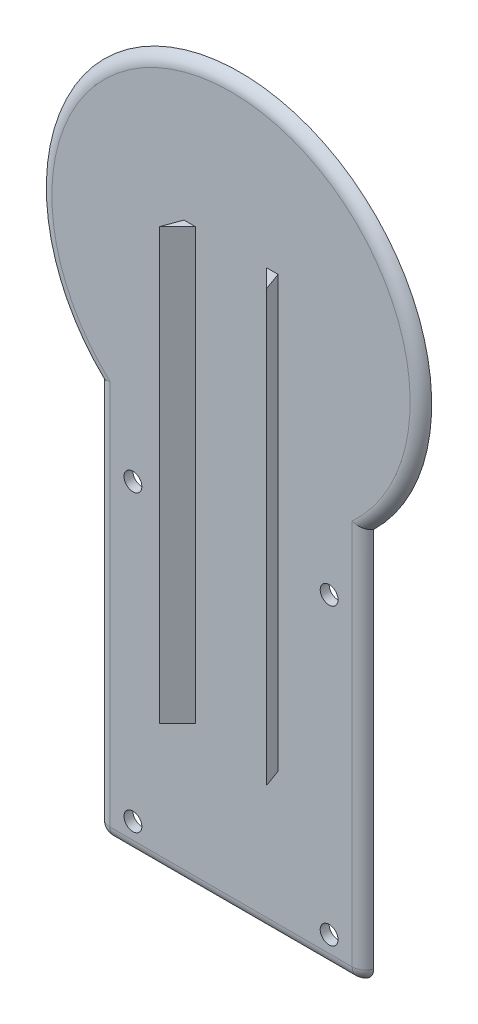
ISO-10303-21;
HEADER;
FILE_DESCRIPTION(('STEP AP214'),'2;1');
FILE_NAME('part.step','',(''),(''),'','','');
FILE_SCHEMA(('AUTOMOTIVE_DESIGN { 1 0 10303 214 1 1 1 1 }'));
ENDSEC;
DATA;
#1=APPLICATION_CONTEXT('core data for automotive mechanical design processes');
#2=APPLICATION_PROTOCOL_DEFINITION('international standard','automotive_design',2000,#1);
#3=PRODUCT_CONTEXT('',#1,'mechanical');
#4=PRODUCT('Part','Part','',(#3));
#5=PRODUCT_RELATED_PRODUCT_CATEGORY('part','',(#4));
#6=PRODUCT_DEFINITION_FORMATION('','',#4);
#7=PRODUCT_DEFINITION_CONTEXT('part definition',#1,'design');
#8=PRODUCT_DEFINITION('design','',#6,#7);
#9=PRODUCT_DEFINITION_SHAPE('','',#8);
#10=(LENGTH_UNIT() NAMED_UNIT(*) SI_UNIT(.MILLI.,.METRE.));
#11=(NAMED_UNIT(*) PLANE_ANGLE_UNIT() SI_UNIT($,.RADIAN.));
#12=(NAMED_UNIT(*) SI_UNIT($,.STERADIAN.) SOLID_ANGLE_UNIT());
#13=UNCERTAINTY_MEASURE_WITH_UNIT(LENGTH_MEASURE(1.E-05),#10,'distance_accuracy_value','');
#14=(GEOMETRIC_REPRESENTATION_CONTEXT(3) GLOBAL_UNCERTAINTY_ASSIGNED_CONTEXT((#13)) GLOBAL_UNIT_ASSIGNED_CONTEXT((#10,
#11,#12)) REPRESENTATION_CONTEXT('',''));
#15=CARTESIAN_POINT('',(0.,0.,0.));
#16=DIRECTION('',(0.,0.,1.));
#17=DIRECTION('',(1.,0.,0.));
#18=AXIS2_PLACEMENT_3D('',#15,#16,#17);
#19=CARTESIAN_POINT('',(0.,0.,2.));
#20=DIRECTION('',(0.,0.,1.));
#21=DIRECTION('',(1.,0.,0.));
#22=AXIS2_PLACEMENT_3D('',#19,#20,#21);
#23=PLANE('',#22);
#24=CARTESIAN_POINT('',(22.0002091886985,-46.5,2.));
#25=DIRECTION('',(0.,0.,1.));
#26=DIRECTION('',(1.,0.,0.));
#27=AXIS2_PLACEMENT_3D('',#24,#25,#26);
#28=CIRCLE('',#27,2.);
#29=CARTESIAN_POINT('',(24.0002091886985,-46.5,2.));
#30=VERTEX_POINT('',#29);
#31=EDGE_CURVE('E472',#30,#30,#28,.T.);
#32=ORIENTED_EDGE('',*,*,#31,.F.);
#33=EDGE_LOOP('',(#32));
#34=FACE_BOUND('',#33,.T.);
#35=CARTESIAN_POINT('',(-22.0002091886985,-112.5,2.));
#36=DIRECTION('',(0.,0.,1.));
#37=DIRECTION('',(1.,0.,0.));
#38=AXIS2_PLACEMENT_3D('',#35,#36,#37);
#39=CIRCLE('',#38,2.);
#40=CARTESIAN_POINT('',(-20.0002091886985,-112.5,2.));
#41=VERTEX_POINT('',#40);
#42=EDGE_CURVE('E475',#41,#41,#39,.T.);
#43=ORIENTED_EDGE('',*,*,#42,.F.);
#44=EDGE_LOOP('',(#43));
#45=FACE_BOUND('',#44,.T.);
#46=CARTESIAN_POINT('',(22.0002091886985,-112.5,2.));
#47=DIRECTION('',(0.,0.,1.));
#48=DIRECTION('',(1.,0.,0.));
#49=AXIS2_PLACEMENT_3D('',#46,#47,#48);
#50=CIRCLE('',#49,2.);
#51=CARTESIAN_POINT('',(24.0002091886985,-112.5,2.));
#52=VERTEX_POINT('',#51);
#53=EDGE_CURVE('E289',#52,#52,#50,.T.);
#54=ORIENTED_EDGE('',*,*,#53,.F.);
#55=EDGE_LOOP('',(#54));
#56=FACE_BOUND('',#55,.T.);
#57=CARTESIAN_POINT('',(-22.0002091886985,-46.5,2.));
#58=DIRECTION('',(0.,0.,1.));
#59=DIRECTION('',(1.,0.,0.));
#60=AXIS2_PLACEMENT_3D('',#57,#58,#59);
#61=CIRCLE('',#60,2.);
#62=CARTESIAN_POINT('',(-20.0002091886985,-46.5,2.));
#63=VERTEX_POINT('',#62);
#64=EDGE_CURVE('E148',#63,#63,#61,.T.);
#65=ORIENTED_EDGE('',*,*,#64,.F.);
#66=EDGE_LOOP('',(#65));
#67=FACE_BOUND('',#66,.T.);
#68=DIRECTION('',(0.,-1.,0.));
#69=VECTOR('',#68,1.);
#70=CARTESIAN_POINT('',(27.1715728752538,-30.8058436014987,2.));
#71=LINE('',#70,#69);
#72=CARTESIAN_POINT('',(27.1715728752538,-116.171572875254,2.));
#73=VERTEX_POINT('',#72);
#74=CARTESIAN_POINT('',(27.1715728752538,-29.588188433167,2.));
#75=VERTEX_POINT('',#74);
#76=EDGE_CURVE('E196',#73,#75,#71,.F.);
#77=ORIENTED_EDGE('',*,*,#76,.T.);
#78=CARTESIAN_POINT('',(0.,0.,2.));
#79=DIRECTION('',(0.,0.,1.));
#80=DIRECTION('',(1.,0.,0.));
#81=AXIS2_PLACEMENT_3D('',#78,#79,#80);
#82=CIRCLE('',#81,40.1715728752538);
#83=CARTESIAN_POINT('',(-27.1715728752538,-29.588188433167,2.));
#84=VERTEX_POINT('',#83);
#85=EDGE_CURVE('E198',#75,#84,#82,.T.);
#86=ORIENTED_EDGE('',*,*,#85,.T.);
#87=DIRECTION('',(0.,1.,0.));
#88=VECTOR('',#87,1.);
#89=CARTESIAN_POINT('',(-27.1715728752538,-119.,2.));
#90=LINE('',#89,#88);
#91=CARTESIAN_POINT('',(-27.1715728752538,-116.171572875254,2.));
#92=VERTEX_POINT('',#91);
#93=EDGE_CURVE('E190',#84,#92,#90,.F.);
#94=ORIENTED_EDGE('',*,*,#93,.T.);
#95=DIRECTION('',(-1.,0.,0.));
#96=VECTOR('',#95,1.);
#97=CARTESIAN_POINT('',(30.,-116.171572875254,2.));
#98=LINE('',#97,#96);
#99=EDGE_CURVE('E193',#92,#73,#98,.F.);
#100=ORIENTED_EDGE('',*,*,#99,.T.);
#101=EDGE_LOOP('',(#77,#86,#94,#100));
#102=FACE_BOUND('',#101,.T.);
#103=DIRECTION('',(0.,1.,0.));
#104=VECTOR('',#103,1.);
#105=CARTESIAN_POINT('',(-8.,-10.,2.));
#106=LINE('',#105,#104);
#107=CARTESIAN_POINT('',(-8.,-86.5,2.));
#108=VERTEX_POINT('',#107);
#109=CARTESIAN_POINT('',(-8.,10.,2.));
#110=VERTEX_POINT('',#109);
#111=EDGE_CURVE('E170',#108,#110,#106,.T.);
#112=ORIENTED_EDGE('',*,*,#111,.F.);
#113=DIRECTION('',(-1.,0.,0.));
#114=VECTOR('',#113,1.);
#115=CARTESIAN_POINT('',(0.,-86.5,2.));
#116=LINE('',#115,#114);
#117=CARTESIAN_POINT('',(-10.5441190629353,-86.5,2.));
#118=VERTEX_POINT('',#117);
#119=EDGE_CURVE('E156',#108,#118,#116,.T.);
#120=ORIENTED_EDGE('',*,*,#119,.T.);
#121=DIRECTION('',(0.,1.,0.));
#122=VECTOR('',#121,1.);
#123=CARTESIAN_POINT('',(-10.5441190629353,0.,2.));
#124=LINE('',#123,#122);
#125=CARTESIAN_POINT('',(-10.5441190629353,10.,2.));
#126=VERTEX_POINT('',#125);
#127=EDGE_CURVE('E176',#118,#126,#124,.T.);
#128=ORIENTED_EDGE('',*,*,#127,.T.);
#129=DIRECTION('',(-1.,0.,0.));
#130=VECTOR('',#129,1.);
#131=CARTESIAN_POINT('',(0.,10.,2.));
#132=LINE('',#131,#130);
#133=EDGE_CURVE('E129',#110,#126,#132,.T.);
#134=ORIENTED_EDGE('',*,*,#133,.F.);
#135=EDGE_LOOP('',(#112,#120,#128,#134));
#136=FACE_BOUND('',#135,.T.);
#137=CARTESIAN_POINT('',(10.5441190629353,-86.5,2.));
#138=VERTEX_POINT('',#137);
#139=CARTESIAN_POINT('',(8.,-86.5,2.));
#140=VERTEX_POINT('',#139);
#141=EDGE_CURVE('E138',#138,#140,#116,.T.);
#142=ORIENTED_EDGE('',*,*,#141,.T.);
#143=DIRECTION('',(0.,1.,0.));
#144=VECTOR('',#143,1.);
#145=CARTESIAN_POINT('',(8.,-10.,2.));
#146=LINE('',#145,#144);
#147=CARTESIAN_POINT('',(8.,10.,2.));
#148=VERTEX_POINT('',#147);
#149=EDGE_CURVE('E130',#140,#148,#146,.T.);
#150=ORIENTED_EDGE('',*,*,#149,.T.);
#151=CARTESIAN_POINT('',(10.5441190629353,10.,2.));
#152=VERTEX_POINT('',#151);
#153=EDGE_CURVE('E175',#152,#148,#132,.T.);
#154=ORIENTED_EDGE('',*,*,#153,.F.);
#155=DIRECTION('',(0.,1.,0.));
#156=VECTOR('',#155,1.);
#157=CARTESIAN_POINT('',(10.5441190629353,0.,2.));
#158=LINE('',#157,#156);
#159=EDGE_CURVE('E178',#138,#152,#158,.T.);
#160=ORIENTED_EDGE('',*,*,#159,.F.);
#161=EDGE_LOOP('',(#142,#150,#154,#160));
#162=FACE_BOUND('',#161,.T.);
#163=ADVANCED_FACE('F34',(#34,#45,#56,#67,#102,#136,#162),#23,.T.);
#164=CARTESIAN_POINT('',(0.,0.,0.));
#165=DIRECTION('',(0.,0.,1.));
#166=DIRECTION('',(1.,0.,0.));
#167=AXIS2_PLACEMENT_3D('',#164,#165,#166);
#168=PLANE('',#167);
#169=CARTESIAN_POINT('',(22.0002091886985,-46.5,0.));
#170=DIRECTION('',(0.,0.,1.));
#171=DIRECTION('',(1.,0.,0.));
#172=AXIS2_PLACEMENT_3D('',#169,#170,#171);
#173=CIRCLE('',#172,2.);
#174=CARTESIAN_POINT('',(24.0002091886985,-46.5,0.));
#175=VERTEX_POINT('',#174);
#176=EDGE_CURVE('E38',#175,#175,#173,.T.);
#177=ORIENTED_EDGE('',*,*,#176,.T.);
#178=EDGE_LOOP('',(#177));
#179=FACE_BOUND('',#178,.T.);
#180=CARTESIAN_POINT('',(-22.0002091886985,-112.5,0.));
#181=DIRECTION('',(0.,0.,1.));
#182=DIRECTION('',(1.,0.,0.));
#183=AXIS2_PLACEMENT_3D('',#180,#181,#182);
#184=CIRCLE('',#183,2.);
#185=CARTESIAN_POINT('',(-20.0002091886985,-112.5,0.));
#186=VERTEX_POINT('',#185);
#187=EDGE_CURVE('E294',#186,#186,#184,.T.);
#188=ORIENTED_EDGE('',*,*,#187,.T.);
#189=EDGE_LOOP('',(#188));
#190=FACE_BOUND('',#189,.T.);
#191=CARTESIAN_POINT('',(22.0002091886985,-112.5,0.));
#192=DIRECTION('',(0.,0.,1.));
#193=DIRECTION('',(1.,0.,0.));
#194=AXIS2_PLACEMENT_3D('',#191,#192,#193);
#195=CIRCLE('',#194,2.);
#196=CARTESIAN_POINT('',(24.0002091886985,-112.5,0.));
#197=VERTEX_POINT('',#196);
#198=EDGE_CURVE('E292',#197,#197,#195,.T.);
#199=ORIENTED_EDGE('',*,*,#198,.T.);
#200=EDGE_LOOP('',(#199));
#201=FACE_BOUND('',#200,.T.);
#202=CARTESIAN_POINT('',(-22.0002091886985,-46.5,0.));
#203=DIRECTION('',(0.,0.,1.));
#204=DIRECTION('',(1.,0.,0.));
#205=AXIS2_PLACEMENT_3D('',#202,#203,#204);
#206=CIRCLE('',#205,2.);
#207=CARTESIAN_POINT('',(-20.0002091886985,-46.5,0.));
#208=VERTEX_POINT('',#207);
#209=EDGE_CURVE('E295',#208,#208,#206,.T.);
#210=ORIENTED_EDGE('',*,*,#209,.T.);
#211=EDGE_LOOP('',(#210));
#212=FACE_BOUND('',#211,.T.);
#213=DIRECTION('',(1.,0.,0.));
#214=VECTOR('',#213,1.);
#215=CARTESIAN_POINT('',(-30.,-119.,0.));
#216=LINE('',#215,#214);
#217=CARTESIAN_POINT('',(-27.1715728752538,-119.,0.));
#218=VERTEX_POINT('',#217);
#219=CARTESIAN_POINT('',(27.1715728752538,-119.,0.));
#220=VERTEX_POINT('',#219);
#221=EDGE_CURVE('E186',#218,#220,#216,.T.);
#222=ORIENTED_EDGE('',*,*,#221,.F.);
#223=CARTESIAN_POINT('',(-27.1715728752538,-116.171572875254,0.));
#224=DIRECTION('',(0.,0.,1.));
#225=DIRECTION('',(1.,0.,0.));
#226=AXIS2_PLACEMENT_3D('',#223,#224,#225);
#227=CIRCLE('',#226,2.82842712474619);
#228=CARTESIAN_POINT('',(-30.,-116.171572875254,0.));
#229=VERTEX_POINT('',#228);
#230=EDGE_CURVE('E43',#218,#229,#227,.F.);
#231=ORIENTED_EDGE('',*,*,#230,.T.);
#232=DIRECTION('',(0.,-1.,0.));
#233=VECTOR('',#232,1.);
#234=CARTESIAN_POINT('',(-30.,-30.8058436014987,0.));
#235=LINE('',#234,#233);
#236=CARTESIAN_POINT('',(-30.,-30.8058436014987,0.));
#237=VERTEX_POINT('',#236);
#238=EDGE_CURVE('E183',#237,#229,#235,.T.);
#239=ORIENTED_EDGE('',*,*,#238,.F.);
#240=CARTESIAN_POINT('',(0.,0.,0.));
#241=DIRECTION('',(0.,0.,1.));
#242=DIRECTION('',(1.,0.,0.));
#243=AXIS2_PLACEMENT_3D('',#240,#241,#242);
#244=CIRCLE('',#243,43.);
#245=CARTESIAN_POINT('',(30.,-30.8058436014987,0.));
#246=VERTEX_POINT('',#245);
#247=EDGE_CURVE('E180',#246,#237,#244,.T.);
#248=ORIENTED_EDGE('',*,*,#247,.F.);
#249=DIRECTION('',(0.,1.,0.));
#250=VECTOR('',#249,1.);
#251=CARTESIAN_POINT('',(30.,-30.8058436014987,0.));
#252=LINE('',#251,#250);
#253=CARTESIAN_POINT('',(30.,-116.171572875254,0.));
#254=VERTEX_POINT('',#253);
#255=EDGE_CURVE('E188',#254,#246,#252,.T.);
#256=ORIENTED_EDGE('',*,*,#255,.F.);
#257=CARTESIAN_POINT('',(27.1715728752538,-116.171572875254,0.));
#258=DIRECTION('',(0.,0.,1.));
#259=DIRECTION('',(1.,0.,0.));
#260=AXIS2_PLACEMENT_3D('',#257,#258,#259);
#261=CIRCLE('',#260,2.82842712474619);
#262=EDGE_CURVE('E51',#254,#220,#261,.F.);
#263=ORIENTED_EDGE('',*,*,#262,.T.);
#264=EDGE_LOOP('',(#222,#231,#239,#248,#256,#263));
#265=FACE_BOUND('',#264,.T.);
#266=ADVANCED_FACE('F240',(#179,#190,#201,#212,#265),#168,.F.);
#267=CARTESIAN_POINT('',(0.,10.,0.));
#268=DIRECTION('',(0.,1.,0.));
#269=DIRECTION('',(0.,0.,1.));
#270=AXIS2_PLACEMENT_3D('',#267,#268,#269);
#271=PLANE('',#270);
#272=DIRECTION('',(-0.707106781186557,0.,0.707106781186538));
#273=VECTOR('',#272,1.);
#274=CARTESIAN_POINT('',(-2.99999999999989,10.,-2.99999999999998));
#275=LINE('',#274,#273);
#276=CARTESIAN_POINT('',(-12.0000000000001,10.,6.));
#277=VERTEX_POINT('',#276);
#278=EDGE_CURVE('E162',#110,#277,#275,.T.);
#279=ORIENTED_EDGE('',*,*,#278,.F.);
#280=ORIENTED_EDGE('',*,*,#133,.T.);
#281=DIRECTION('',(0.342020143325667,0.,-0.939692620785909));
#282=VECTOR('',#281,1.);
#283=CARTESIAN_POINT('',(-8.66790382965438,10.,-3.15485898747619));
#284=LINE('',#283,#282);
#285=EDGE_CURVE('E159',#277,#126,#284,.T.);
#286=ORIENTED_EDGE('',*,*,#285,.F.);
#287=EDGE_LOOP('',(#279,#280,#286));
#288=FACE_BOUND('',#287,.T.);
#289=ADVANCED_FACE('F246',(#288),#271,.T.);
#290=CARTESIAN_POINT('',(-8.66790382965438,-10.,-3.15485898747619));
#291=DIRECTION('',(0.939692620785909,0.,0.342020143325667));
#292=DIRECTION('',(0.342020143325667,0.,-0.939692620785909));
#293=AXIS2_PLACEMENT_3D('',#290,#291,#292);
#294=PLANE('',#293);
#295=ORIENTED_EDGE('',*,*,#285,.T.);
#296=ORIENTED_EDGE('',*,*,#127,.F.);
#297=DIRECTION('',(-0.342020143325666,0.,0.939692620785909));
#298=VECTOR('',#297,1.);
#299=CARTESIAN_POINT('',(-10.5441190629353,-86.5,2.));
#300=LINE('',#299,#298);
#301=CARTESIAN_POINT('',(-12.0000000000001,-86.5,6.));
#302=VERTEX_POINT('',#301);
#303=EDGE_CURVE('E139',#118,#302,#300,.T.);
#304=ORIENTED_EDGE('',*,*,#303,.T.);
#305=DIRECTION('',(0.,1.,0.));
#306=VECTOR('',#305,1.);
#307=CARTESIAN_POINT('',(-12.0000000000001,-10.,6.));
#308=LINE('',#307,#306);
#309=EDGE_CURVE('E167',#302,#277,#308,.T.);
#310=ORIENTED_EDGE('',*,*,#309,.T.);
#311=EDGE_LOOP('',(#295,#296,#304,#310));
#312=FACE_BOUND('',#311,.T.);
#313=ADVANCED_FACE('F251',(#312),#294,.F.);
#314=CARTESIAN_POINT('',(-2.99999999999989,-10.,-2.99999999999998));
#315=DIRECTION('',(-0.707106781186538,0.,-0.707106781186557));
#316=DIRECTION('',(-0.707106781186557,0.,0.707106781186538));
#317=AXIS2_PLACEMENT_3D('',#314,#315,#316);
#318=PLANE('',#317);
#319=ORIENTED_EDGE('',*,*,#278,.T.);
#320=ORIENTED_EDGE('',*,*,#309,.F.);
#321=DIRECTION('',(0.707106781186557,0.,-0.707106781186538));
#322=VECTOR('',#321,1.);
#323=CARTESIAN_POINT('',(-12.0000000000001,-86.5,6.));
#324=LINE('',#323,#322);
#325=EDGE_CURVE('E153',#302,#108,#324,.T.);
#326=ORIENTED_EDGE('',*,*,#325,.T.);
#327=ORIENTED_EDGE('',*,*,#111,.T.);
#328=EDGE_LOOP('',(#319,#320,#326,#327));
#329=FACE_BOUND('',#328,.T.);
#330=ADVANCED_FACE('F254',(#329),#318,.F.);
#331=DIRECTION('',(-0.342020143325666,0.,-0.93969262078591));
#332=VECTOR('',#331,1.);
#333=CARTESIAN_POINT('',(8.66790382965438,10.,-3.15485898747619));
#334=LINE('',#333,#332);
#335=CARTESIAN_POINT('',(12.0000000000001,10.,6.));
#336=VERTEX_POINT('',#335);
#337=EDGE_CURVE('E124',#336,#152,#334,.T.);
#338=ORIENTED_EDGE('',*,*,#337,.T.);
#339=ORIENTED_EDGE('',*,*,#153,.T.);
#340=DIRECTION('',(0.707106781186556,0.,0.707106781186539));
#341=VECTOR('',#340,1.);
#342=CARTESIAN_POINT('',(2.9999999999999,10.,-2.99999999999998));
#343=LINE('',#342,#341);
#344=EDGE_CURVE('E165',#148,#336,#343,.T.);
#345=ORIENTED_EDGE('',*,*,#344,.T.);
#346=EDGE_LOOP('',(#338,#339,#345));
#347=FACE_BOUND('',#346,.T.);
#348=ADVANCED_FACE('F258',(#347),#271,.T.);
#349=CARTESIAN_POINT('',(8.66790382965438,-10.,-3.15485898747619));
#350=DIRECTION('',(0.93969262078591,0.,-0.342020143325666));
#351=DIRECTION('',(-0.342020143325666,0.,-0.93969262078591));
#352=AXIS2_PLACEMENT_3D('',#349,#350,#351);
#353=PLANE('',#352);
#354=ORIENTED_EDGE('',*,*,#337,.F.);
#355=DIRECTION('',(0.,1.,0.));
#356=VECTOR('',#355,1.);
#357=CARTESIAN_POINT('',(12.0000000000001,-10.,6.));
#358=LINE('',#357,#356);
#359=CARTESIAN_POINT('',(12.0000000000001,-86.5,6.));
#360=VERTEX_POINT('',#359);
#361=EDGE_CURVE('E119',#360,#336,#358,.T.);
#362=ORIENTED_EDGE('',*,*,#361,.F.);
#363=DIRECTION('',(-0.342020143325666,0.,-0.93969262078591));
#364=VECTOR('',#363,1.);
#365=CARTESIAN_POINT('',(12.0000000000001,-86.5,6.));
#366=LINE('',#365,#364);
#367=EDGE_CURVE('E122',#360,#138,#366,.T.);
#368=ORIENTED_EDGE('',*,*,#367,.T.);
#369=ORIENTED_EDGE('',*,*,#159,.T.);
#370=EDGE_LOOP('',(#354,#362,#368,#369));
#371=FACE_BOUND('',#370,.T.);
#372=ADVANCED_FACE('F121',(#371),#353,.T.);
#373=CARTESIAN_POINT('',(2.9999999999999,-10.,-2.99999999999998));
#374=DIRECTION('',(-0.707106781186539,0.,0.707106781186556));
#375=DIRECTION('',(0.707106781186556,0.,0.707106781186539));
#376=AXIS2_PLACEMENT_3D('',#373,#374,#375);
#377=PLANE('',#376);
#378=ORIENTED_EDGE('',*,*,#344,.F.);
#379=ORIENTED_EDGE('',*,*,#149,.F.);
#380=DIRECTION('',(0.707106781186557,0.,0.707106781186539));
#381=VECTOR('',#380,1.);
#382=CARTESIAN_POINT('',(8.,-86.5,2.));
#383=LINE('',#382,#381);
#384=EDGE_CURVE('E136',#140,#360,#383,.T.);
#385=ORIENTED_EDGE('',*,*,#384,.T.);
#386=ORIENTED_EDGE('',*,*,#361,.T.);
#387=EDGE_LOOP('',(#378,#379,#385,#386));
#388=FACE_BOUND('',#387,.T.);
#389=ADVANCED_FACE('F141',(#388),#377,.T.);
#390=CARTESIAN_POINT('',(0.,-86.5,0.));
#391=DIRECTION('',(0.,1.,0.));
#392=DIRECTION('',(0.,0.,1.));
#393=AXIS2_PLACEMENT_3D('',#390,#391,#392);
#394=PLANE('',#393);
#395=ORIENTED_EDGE('',*,*,#141,.F.);
#396=ORIENTED_EDGE('',*,*,#367,.F.);
#397=ORIENTED_EDGE('',*,*,#384,.F.);
#398=EDGE_LOOP('',(#395,#396,#397));
#399=FACE_BOUND('',#398,.T.);
#400=ADVANCED_FACE('F135',(#399),#394,.F.);
#401=ORIENTED_EDGE('',*,*,#119,.F.);
#402=ORIENTED_EDGE('',*,*,#325,.F.);
#403=ORIENTED_EDGE('',*,*,#303,.F.);
#404=EDGE_LOOP('',(#401,#402,#403));
#405=FACE_BOUND('',#404,.T.);
#406=ADVANCED_FACE('F230',(#405),#394,.F.);
#407=CARTESIAN_POINT('',(-30.,-116.171572875254,-1.));
#408=DIRECTION('',(1.,0.,0.));
#409=DIRECTION('',(0.,0.,-1.));
#410=AXIS2_PLACEMENT_3D('',#407,#408,#409);
#411=CYLINDRICAL_SURFACE('',#410,3.);
#412=ORIENTED_EDGE('',*,*,#99,.F.);
#413=CARTESIAN_POINT('',(-27.1715728752538,-116.171572875254,-1.));
#414=DIRECTION('',(1.,0.,0.));
#415=DIRECTION('',(0.,0.,-1.));
#416=AXIS2_PLACEMENT_3D('',#413,#414,#415);
#417=CIRCLE('',#416,3.);
#418=EDGE_CURVE('E303',#92,#218,#417,.T.);
#419=ORIENTED_EDGE('',*,*,#418,.T.);
#420=ORIENTED_EDGE('',*,*,#221,.T.);
#421=CARTESIAN_POINT('',(27.1715728752538,-116.171572875254,-1.));
#422=DIRECTION('',(1.,0.,0.));
#423=DIRECTION('',(0.,0.,-1.));
#424=AXIS2_PLACEMENT_3D('',#421,#422,#423);
#425=CIRCLE('',#424,3.);
#426=EDGE_CURVE('E305',#220,#73,#425,.F.);
#427=ORIENTED_EDGE('',*,*,#426,.T.);
#428=EDGE_LOOP('',(#412,#419,#420,#427));
#429=FACE_BOUND('',#428,.T.);
#430=ADVANCED_FACE('F227',(#429),#411,.T.);
#431=CARTESIAN_POINT('',(27.1715728752538,-30.8058436014987,-1.));
#432=DIRECTION('',(0.,1.,0.));
#433=DIRECTION('',(-1.,0.,0.));
#434=AXIS2_PLACEMENT_3D('',#431,#432,#433);
#435=CYLINDRICAL_SURFACE('',#434,3.);
#436=ORIENTED_EDGE('',*,*,#76,.F.);
#437=CARTESIAN_POINT('',(27.1715728752538,-116.171572875254,-1.));
#438=DIRECTION('',(0.,1.,0.));
#439=DIRECTION('',(-1.,0.,0.));
#440=AXIS2_PLACEMENT_3D('',#437,#438,#439);
#441=CIRCLE('',#440,3.);
#442=EDGE_CURVE('E11',#73,#254,#441,.T.);
#443=ORIENTED_EDGE('',*,*,#442,.T.);
#444=ORIENTED_EDGE('',*,*,#255,.T.);
#445=CARTESIAN_POINT('',(30.,-30.8058436014987,0.));
#446=CARTESIAN_POINT('',(29.9721197633391,-30.7940779838418,0.0788894831782543));
#447=CARTESIAN_POINT('',(29.9409891124215,-30.7809343938609,0.156407964111184));
#448=CARTESIAN_POINT('',(29.8726152644987,-30.7520439803396,0.308157399698374));
#449=CARTESIAN_POINT('',(29.835374670111,-30.736298265191,0.382389737110016));
#450=CARTESIAN_POINT('',(29.7552932290226,-30.7024088400981,0.526821732723308));
#451=CARTESIAN_POINT('',(29.7124736003264,-30.684274212836,0.597035288036669));
#452=CARTESIAN_POINT('',(29.621562507006,-30.6457337570142,0.733282031315564));
#453=CARTESIAN_POINT('',(29.5734706082547,-30.6253277414228,0.799314874327483));
#454=CARTESIAN_POINT('',(29.4220709217452,-30.5610155989233,0.990372263998825));
#455=CARTESIAN_POINT('',(29.3114568798462,-30.5139383582216,1.1086811682807));
#456=CARTESIAN_POINT('',(29.0745003174388,-30.4128190992652,1.32479102848972));
#457=CARTESIAN_POINT('',(28.9481437982474,-30.3587708806818,1.42257352129398));
#458=CARTESIAN_POINT('',(28.6757335867648,-30.2419026650558,1.60105877031366));
#459=CARTESIAN_POINT('',(28.528965190405,-30.1787570456328,1.68045679016511));
#460=CARTESIAN_POINT('',(28.2260662393527,-30.0479947707403,1.81343140226878));
#461=CARTESIAN_POINT('',(28.0699366403543,-29.9803785716044,1.86701062535619));
#462=CARTESIAN_POINT('',(27.7917451011588,-29.8594721604503,1.93778747643048));
#463=CARTESIAN_POINT('',(27.6708308549772,-29.8067850588438,1.96071101766669));
#464=CARTESIAN_POINT('',(27.4276490423639,-29.7005334380498,1.99155497442354));
#465=CARTESIAN_POINT('',(27.3053841590363,-29.6469705825021,1.99950110793562));
#466=CARTESIAN_POINT('',(27.1793634499715,-29.5916111875776,1.99999242663015));
#467=CARTESIAN_POINT('',(27.1754680766473,-29.5898998473104,2.00000001366719));
#468=CARTESIAN_POINT('',(27.1715728752538,-29.588188433167,2.));
#469=B_SPLINE_CURVE_WITH_KNOTS('',3,(#445,#446,#447,#448,#449,#450,#451,#452,#453,#454,#455,
#456,#457,#458,#459,#460,#461,#462,#463,#464,#465,#466,#467,#468),.UNSPECIFIED.,.F.,.F.,(4,2,2,
2,2,2,2,2,2,2,2,4),(0.,0.253375081128568,0.506642512414334,0.758973403898373,1.01132508832748,
1.51489983352092,2.01892561206644,2.55192145043157,3.08486296709892,3.48571024336906,
3.88586858788909,3.89863272744851),.UNSPECIFIED.);
#470=EDGE_CURVE('E142',#75,#246,#469,.F.);
#471=ORIENTED_EDGE('',*,*,#470,.F.);
#472=EDGE_LOOP('',(#436,#443,#444,#471));
#473=FACE_BOUND('',#472,.T.);
#474=ADVANCED_FACE('F222',(#473),#435,.T.);
#475=CARTESIAN_POINT('',(-27.1715728752538,-30.8058436014987,-1.));
#476=DIRECTION('',(0.,-1.,0.));
#477=DIRECTION('',(1.,0.,0.));
#478=AXIS2_PLACEMENT_3D('',#475,#476,#477);
#479=CYLINDRICAL_SURFACE('',#478,3.);
#480=ORIENTED_EDGE('',*,*,#238,.T.);
#481=CARTESIAN_POINT('',(-27.1715728752538,-116.171572875254,-1.));
#482=DIRECTION('',(0.,-1.,0.));
#483=DIRECTION('',(1.,0.,0.));
#484=AXIS2_PLACEMENT_3D('',#481,#482,#483);
#485=CIRCLE('',#484,3.);
#486=EDGE_CURVE('E201',#229,#92,#485,.F.);
#487=ORIENTED_EDGE('',*,*,#486,.T.);
#488=ORIENTED_EDGE('',*,*,#93,.F.);
#489=CARTESIAN_POINT('',(-30.,-30.8058436014987,0.));
#490=CARTESIAN_POINT('',(-29.9721197633391,-30.7940779838418,0.0788894831782543));
#491=CARTESIAN_POINT('',(-29.9409891124215,-30.7809343938609,0.156407964111184));
#492=CARTESIAN_POINT('',(-29.8726152644987,-30.7520439803396,0.308157399698374));
#493=CARTESIAN_POINT('',(-29.835374670111,-30.736298265191,0.382389737110016));
#494=CARTESIAN_POINT('',(-29.7552932290226,-30.7024088400981,0.526821732723308));
#495=CARTESIAN_POINT('',(-29.7124736003264,-30.684274212836,0.597035288036669));
#496=CARTESIAN_POINT('',(-29.621562507006,-30.6457337570142,0.733282031315564));
#497=CARTESIAN_POINT('',(-29.5734706082547,-30.6253277414228,0.799314874327483));
#498=CARTESIAN_POINT('',(-29.4220709217452,-30.5610155989233,0.990372263998825));
#499=CARTESIAN_POINT('',(-29.3114568798462,-30.5139383582216,1.1086811682807));
#500=CARTESIAN_POINT('',(-29.0745003174388,-30.4128190992652,1.32479102848972));
#501=CARTESIAN_POINT('',(-28.9481437982474,-30.3587708806818,1.42257352129398));
#502=CARTESIAN_POINT('',(-28.6757335867648,-30.2419026650558,1.60105877031366));
#503=CARTESIAN_POINT('',(-28.528965190405,-30.1787570456328,1.68045679016511));
#504=CARTESIAN_POINT('',(-28.2260662393527,-30.0479947707403,1.81343140226878));
#505=CARTESIAN_POINT('',(-28.0699366403543,-29.9803785716044,1.86701062535619));
#506=CARTESIAN_POINT('',(-27.7917451011588,-29.8594721604503,1.93778747643048));
#507=CARTESIAN_POINT('',(-27.6708308549772,-29.8067850588438,1.96071101766669));
#508=CARTESIAN_POINT('',(-27.4276490423639,-29.7005334380498,1.99155497442354));
#509=CARTESIAN_POINT('',(-27.3053841590363,-29.6469705825021,1.99950110793562));
#510=CARTESIAN_POINT('',(-27.1793634499715,-29.5916111875776,1.99999242663015));
#511=CARTESIAN_POINT('',(-27.1754680766473,-29.5898998473104,2.00000001366719));
#512=CARTESIAN_POINT('',(-27.1715728752538,-29.588188433167,2.));
#513=B_SPLINE_CURVE_WITH_KNOTS('',3,(#489,#490,#491,#492,#493,#494,#495,#496,#497,#498,#499,
#500,#501,#502,#503,#504,#505,#506,#507,#508,#509,#510,#511,#512),.UNSPECIFIED.,.F.,.F.,(4,2,2,
2,2,2,2,2,2,2,2,4),(0.,0.253375081128568,0.506642512414334,0.758973403898373,1.01132508832748,
1.51489983352092,2.01892561206644,2.55192145043157,3.08486296709892,3.48571024336906,
3.88586858788909,3.89863272744851),.UNSPECIFIED.);
#514=EDGE_CURVE('E145',#237,#84,#513,.T.);
#515=ORIENTED_EDGE('',*,*,#514,.F.);
#516=EDGE_LOOP('',(#480,#487,#488,#515));
#517=FACE_BOUND('',#516,.T.);
#518=ADVANCED_FACE('F214',(#517),#479,.T.);
#519=CARTESIAN_POINT('',(0.,0.,-1.));
#520=DIRECTION('',(0.,0.,-1.));
#521=DIRECTION('',(-1.,0.,0.));
#522=AXIS2_PLACEMENT_3D('',#519,#520,#521);
#523=TOROIDAL_SURFACE('',#522,40.1715728752538,3.);
#524=ORIENTED_EDGE('',*,*,#470,.T.);
#525=ORIENTED_EDGE('',*,*,#247,.T.);
#526=ORIENTED_EDGE('',*,*,#514,.T.);
#527=ORIENTED_EDGE('',*,*,#85,.F.);
#528=EDGE_LOOP('',(#524,#525,#526,#527));
#529=FACE_BOUND('',#528,.T.);
#530=ADVANCED_FACE('F217',(#529),#523,.T.);
#531=CARTESIAN_POINT('',(-27.1715728752538,-116.171572875254,-1.));
#532=DIRECTION('',(0.,0.,1.));
#533=DIRECTION('',(1.,0.,0.));
#534=AXIS2_PLACEMENT_3D('',#531,#532,#533);
#535=SPHERICAL_SURFACE('',#534,3.);
#536=ORIENTED_EDGE('',*,*,#230,.F.);
#537=ORIENTED_EDGE('',*,*,#418,.F.);
#538=ORIENTED_EDGE('',*,*,#486,.F.);
#539=EDGE_LOOP('',(#536,#537,#538));
#540=FACE_BOUND('',#539,.T.);
#541=ADVANCED_FACE('F220',(#540),#535,.T.);
#542=CARTESIAN_POINT('',(27.1715728752538,-116.171572875254,-1.));
#543=DIRECTION('',(0.,0.,1.));
#544=DIRECTION('',(1.,0.,0.));
#545=AXIS2_PLACEMENT_3D('',#542,#543,#544);
#546=SPHERICAL_SURFACE('',#545,3.);
#547=ORIENTED_EDGE('',*,*,#442,.F.);
#548=ORIENTED_EDGE('',*,*,#426,.F.);
#549=ORIENTED_EDGE('',*,*,#262,.F.);
#550=EDGE_LOOP('',(#547,#548,#549));
#551=FACE_BOUND('',#550,.T.);
#552=ADVANCED_FACE('F36',(#551),#546,.T.);
#553=CARTESIAN_POINT('',(-22.0002091886985,-46.5,-8.));
#554=DIRECTION('',(0.,0.,1.));
#555=DIRECTION('',(1.,0.,0.));
#556=AXIS2_PLACEMENT_3D('',#553,#554,#555);
#557=CYLINDRICAL_SURFACE('',#556,2.);
#558=ORIENTED_EDGE('',*,*,#64,.T.);
#559=EDGE_LOOP('',(#558));
#560=FACE_BOUND('',#559,.T.);
#561=ORIENTED_EDGE('',*,*,#209,.F.);
#562=EDGE_LOOP('',(#561));
#563=FACE_BOUND('',#562,.T.);
#564=ADVANCED_FACE('F237',(#560,#563),#557,.F.);
#565=CARTESIAN_POINT('',(22.0002091886985,-112.5,-8.));
#566=DIRECTION('',(0.,0.,1.));
#567=DIRECTION('',(1.,0.,0.));
#568=AXIS2_PLACEMENT_3D('',#565,#566,#567);
#569=CYLINDRICAL_SURFACE('',#568,2.);
#570=ORIENTED_EDGE('',*,*,#53,.T.);
#571=EDGE_LOOP('',(#570));
#572=FACE_BOUND('',#571,.T.);
#573=ORIENTED_EDGE('',*,*,#198,.F.);
#574=EDGE_LOOP('',(#573));
#575=FACE_BOUND('',#574,.T.);
#576=ADVANCED_FACE('F272',(#572,#575),#569,.F.);
#577=CARTESIAN_POINT('',(-22.0002091886985,-112.5,-8.));
#578=DIRECTION('',(0.,0.,1.));
#579=DIRECTION('',(1.,0.,0.));
#580=AXIS2_PLACEMENT_3D('',#577,#578,#579);
#581=CYLINDRICAL_SURFACE('',#580,2.);
#582=ORIENTED_EDGE('',*,*,#42,.T.);
#583=EDGE_LOOP('',(#582));
#584=FACE_BOUND('',#583,.T.);
#585=ORIENTED_EDGE('',*,*,#187,.F.);
#586=EDGE_LOOP('',(#585));
#587=FACE_BOUND('',#586,.T.);
#588=ADVANCED_FACE('F274',(#584,#587),#581,.F.);
#589=CARTESIAN_POINT('',(22.0002091886985,-46.5,-8.));
#590=DIRECTION('',(0.,0.,1.));
#591=DIRECTION('',(1.,0.,0.));
#592=AXIS2_PLACEMENT_3D('',#589,#590,#591);
#593=CYLINDRICAL_SURFACE('',#592,2.);
#594=ORIENTED_EDGE('',*,*,#31,.T.);
#595=EDGE_LOOP('',(#594));
#596=FACE_BOUND('',#595,.T.);
#597=ORIENTED_EDGE('',*,*,#176,.F.);
#598=EDGE_LOOP('',(#597));
#599=FACE_BOUND('',#598,.T.);
#600=ADVANCED_FACE('F277',(#596,#599),#593,.F.);
#601=CLOSED_SHELL('',(#163,#266,#289,#313,#330,#348,#372,#389,#400,#406,#430,#474,#518,#530,
#541,#552,#564,#576,#588,#600));
#602=MANIFOLD_SOLID_BREP('B2',#601);
#603=ADVANCED_BREP_SHAPE_REPRESENTATION('',(#18,#602),#14);
#604=SHAPE_DEFINITION_REPRESENTATION(#9,#603);
ENDSEC;
END-ISO-10303-21;
